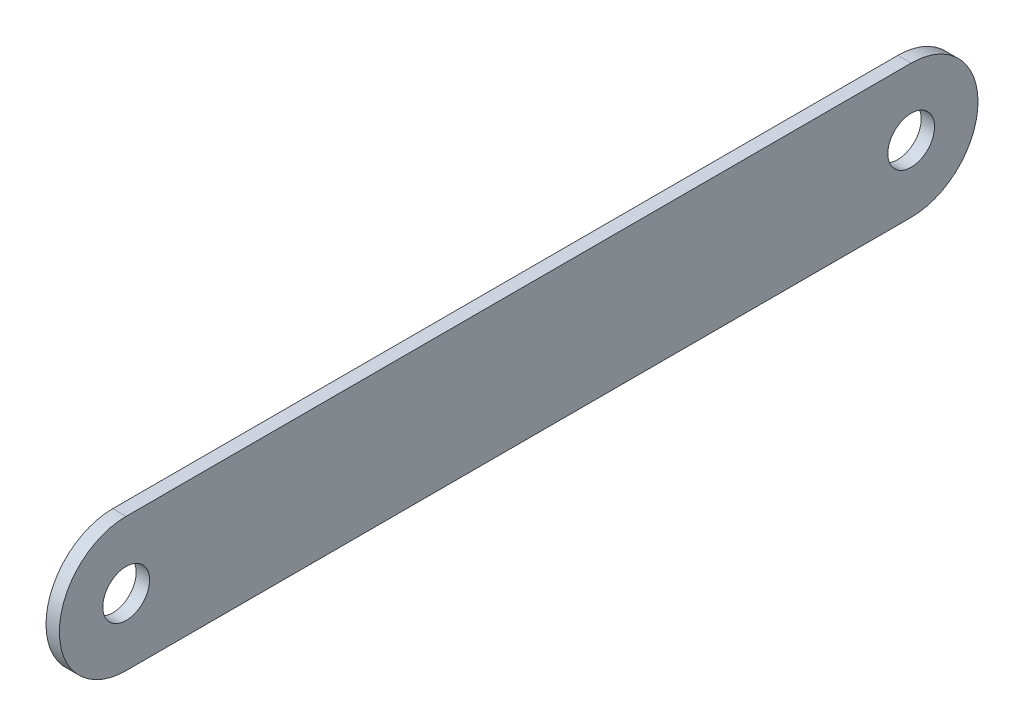
ISO-10303-21;
HEADER;
FILE_DESCRIPTION(('STEP AP214'),'2;1');
FILE_NAME('part.step','',(''),(''),'','','');
FILE_SCHEMA(('AUTOMOTIVE_DESIGN { 1 0 10303 214 1 1 1 1 }'));
ENDSEC;
DATA;
#1=APPLICATION_CONTEXT('core data for automotive mechanical design processes');
#2=APPLICATION_PROTOCOL_DEFINITION('international standard','automotive_design',2000,#1);
#3=PRODUCT_CONTEXT('',#1,'mechanical');
#4=PRODUCT('Part','Part','',(#3));
#5=PRODUCT_RELATED_PRODUCT_CATEGORY('part','',(#4));
#6=PRODUCT_DEFINITION_FORMATION('','',#4);
#7=PRODUCT_DEFINITION_CONTEXT('part definition',#1,'design');
#8=PRODUCT_DEFINITION('design','',#6,#7);
#9=PRODUCT_DEFINITION_SHAPE('','',#8);
#10=(LENGTH_UNIT() NAMED_UNIT(*) SI_UNIT(.MILLI.,.METRE.));
#11=(NAMED_UNIT(*) PLANE_ANGLE_UNIT() SI_UNIT($,.RADIAN.));
#12=(NAMED_UNIT(*) SI_UNIT($,.STERADIAN.) SOLID_ANGLE_UNIT());
#13=UNCERTAINTY_MEASURE_WITH_UNIT(LENGTH_MEASURE(1.E-05),#10,'distance_accuracy_value','');
#14=(GEOMETRIC_REPRESENTATION_CONTEXT(3) GLOBAL_UNCERTAINTY_ASSIGNED_CONTEXT((#13)) GLOBAL_UNIT_ASSIGNED_CONTEXT((#10,
#11,#12)) REPRESENTATION_CONTEXT('',''));
#15=CARTESIAN_POINT('',(0.,0.,0.));
#16=DIRECTION('',(0.,0.,1.));
#17=DIRECTION('',(1.,0.,0.));
#18=AXIS2_PLACEMENT_3D('',#15,#16,#17);
#19=CARTESIAN_POINT('',(-4.,0.,0.));
#20=DIRECTION('',(1.,0.,0.));
#21=DIRECTION('',(0.,0.,-1.));
#22=AXIS2_PLACEMENT_3D('',#19,#20,#21);
#23=CYLINDRICAL_SURFACE('',#22,20.);
#24=CARTESIAN_POINT('',(0.,0.,0.));
#25=DIRECTION('',(1.,0.,0.));
#26=DIRECTION('',(0.,0.,-1.));
#27=AXIS2_PLACEMENT_3D('',#24,#25,#26);
#28=CIRCLE('',#27,20.);
#29=CARTESIAN_POINT('',(0.,20.,0.));
#30=VERTEX_POINT('',#29);
#31=CARTESIAN_POINT('',(0.,-20.,0.));
#32=VERTEX_POINT('',#31);
#33=EDGE_CURVE('E107',#30,#32,#28,.T.);
#34=ORIENTED_EDGE('',*,*,#33,.F.);
#35=DIRECTION('',(1.,0.,0.));
#36=VECTOR('',#35,1.);
#37=CARTESIAN_POINT('',(-4.,20.,0.));
#38=LINE('',#37,#36);
#39=CARTESIAN_POINT('',(-4.,20.,0.));
#40=VERTEX_POINT('',#39);
#41=EDGE_CURVE('E11',#40,#30,#38,.T.);
#42=ORIENTED_EDGE('',*,*,#41,.F.);
#43=CARTESIAN_POINT('',(-4.,0.,0.));
#44=DIRECTION('',(1.,0.,0.));
#45=DIRECTION('',(0.,0.,-1.));
#46=AXIS2_PLACEMENT_3D('',#43,#44,#45);
#47=CIRCLE('',#46,20.);
#48=CARTESIAN_POINT('',(-4.,-20.,0.));
#49=VERTEX_POINT('',#48);
#50=EDGE_CURVE('E100',#40,#49,#47,.T.);
#51=ORIENTED_EDGE('',*,*,#50,.T.);
#52=DIRECTION('',(1.,0.,0.));
#53=VECTOR('',#52,1.);
#54=CARTESIAN_POINT('',(-4.,-20.,0.));
#55=LINE('',#54,#53);
#56=EDGE_CURVE('E45',#49,#32,#55,.T.);
#57=ORIENTED_EDGE('',*,*,#56,.T.);
#58=EDGE_LOOP('',(#34,#42,#51,#57));
#59=FACE_BOUND('',#58,.T.);
#60=ADVANCED_FACE('F42',(#59),#23,.T.);
#61=CARTESIAN_POINT('',(-4.,20.,0.));
#62=DIRECTION('',(0.,1.,0.));
#63=DIRECTION('',(0.,0.,1.));
#64=AXIS2_PLACEMENT_3D('',#61,#62,#63);
#65=PLANE('',#64);
#66=DIRECTION('',(0.,0.,1.));
#67=VECTOR('',#66,1.);
#68=CARTESIAN_POINT('',(0.,20.,0.));
#69=LINE('',#68,#67);
#70=CARTESIAN_POINT('',(0.,20.,-235.));
#71=VERTEX_POINT('',#70);
#72=EDGE_CURVE('E102',#71,#30,#69,.T.);
#73=ORIENTED_EDGE('',*,*,#72,.F.);
#74=DIRECTION('',(1.,0.,0.));
#75=VECTOR('',#74,1.);
#76=CARTESIAN_POINT('',(-4.,20.,-235.));
#77=LINE('',#76,#75);
#78=CARTESIAN_POINT('',(-4.,20.,-235.));
#79=VERTEX_POINT('',#78);
#80=EDGE_CURVE('E51',#79,#71,#77,.T.);
#81=ORIENTED_EDGE('',*,*,#80,.F.);
#82=DIRECTION('',(0.,0.,1.));
#83=VECTOR('',#82,1.);
#84=CARTESIAN_POINT('',(-4.,20.,0.));
#85=LINE('',#84,#83);
#86=EDGE_CURVE('E97',#79,#40,#85,.T.);
#87=ORIENTED_EDGE('',*,*,#86,.T.);
#88=ORIENTED_EDGE('',*,*,#41,.T.);
#89=EDGE_LOOP('',(#73,#81,#87,#88));
#90=FACE_BOUND('',#89,.T.);
#91=ADVANCED_FACE('F118',(#90),#65,.T.);
#92=CARTESIAN_POINT('',(-4.,0.,-235.));
#93=DIRECTION('',(1.,0.,0.));
#94=DIRECTION('',(0.,0.,-1.));
#95=AXIS2_PLACEMENT_3D('',#92,#93,#94);
#96=CYLINDRICAL_SURFACE('',#95,20.);
#97=CARTESIAN_POINT('',(0.,0.,-235.));
#98=DIRECTION('',(1.,0.,0.));
#99=DIRECTION('',(0.,0.,-1.));
#100=AXIS2_PLACEMENT_3D('',#97,#98,#99);
#101=CIRCLE('',#100,20.);
#102=CARTESIAN_POINT('',(0.,-20.,-235.));
#103=VERTEX_POINT('',#102);
#104=EDGE_CURVE('E92',#103,#71,#101,.T.);
#105=ORIENTED_EDGE('',*,*,#104,.F.);
#106=DIRECTION('',(1.,0.,0.));
#107=VECTOR('',#106,1.);
#108=CARTESIAN_POINT('',(-4.,-20.,-235.));
#109=LINE('',#108,#107);
#110=CARTESIAN_POINT('',(-4.,-20.,-235.));
#111=VERTEX_POINT('',#110);
#112=EDGE_CURVE('E87',#111,#103,#109,.T.);
#113=ORIENTED_EDGE('',*,*,#112,.F.);
#114=CARTESIAN_POINT('',(-4.,0.,-235.));
#115=DIRECTION('',(1.,0.,0.));
#116=DIRECTION('',(0.,0.,-1.));
#117=AXIS2_PLACEMENT_3D('',#114,#115,#116);
#118=CIRCLE('',#117,20.);
#119=EDGE_CURVE('E90',#111,#79,#118,.T.);
#120=ORIENTED_EDGE('',*,*,#119,.T.);
#121=ORIENTED_EDGE('',*,*,#80,.T.);
#122=EDGE_LOOP('',(#105,#113,#120,#121));
#123=FACE_BOUND('',#122,.T.);
#124=ADVANCED_FACE('F89',(#123),#96,.T.);
#125=CARTESIAN_POINT('',(-4.,-20.,0.));
#126=DIRECTION('',(0.,-1.,0.));
#127=DIRECTION('',(0.,0.,-1.));
#128=AXIS2_PLACEMENT_3D('',#125,#126,#127);
#129=PLANE('',#128);
#130=DIRECTION('',(0.,0.,-1.));
#131=VECTOR('',#130,1.);
#132=CARTESIAN_POINT('',(0.,-20.,0.));
#133=LINE('',#132,#131);
#134=EDGE_CURVE('E110',#32,#103,#133,.T.);
#135=ORIENTED_EDGE('',*,*,#134,.F.);
#136=ORIENTED_EDGE('',*,*,#56,.F.);
#137=DIRECTION('',(0.,0.,-1.));
#138=VECTOR('',#137,1.);
#139=CARTESIAN_POINT('',(-4.,-20.,0.));
#140=LINE('',#139,#138);
#141=EDGE_CURVE('E96',#49,#111,#140,.T.);
#142=ORIENTED_EDGE('',*,*,#141,.T.);
#143=ORIENTED_EDGE('',*,*,#112,.T.);
#144=EDGE_LOOP('',(#135,#136,#142,#143));
#145=FACE_BOUND('',#144,.T.);
#146=ADVANCED_FACE('F99',(#145),#129,.T.);
#147=CARTESIAN_POINT('',(-4.,0.,0.));
#148=DIRECTION('',(1.,0.,0.));
#149=DIRECTION('',(0.,0.,-1.));
#150=AXIS2_PLACEMENT_3D('',#147,#148,#149);
#151=PLANE('',#150);
#152=CARTESIAN_POINT('',(-4.,0.,-235.));
#153=DIRECTION('',(1.,0.,0.));
#154=DIRECTION('',(0.,0.,-1.));
#155=AXIS2_PLACEMENT_3D('',#152,#153,#154);
#156=CIRCLE('',#155,6.99999999999998);
#157=CARTESIAN_POINT('',(-4.,0.,-242.));
#158=VERTEX_POINT('',#157);
#159=EDGE_CURVE('E151',#158,#158,#156,.T.);
#160=ORIENTED_EDGE('',*,*,#159,.T.);
#161=EDGE_LOOP('',(#160));
#162=FACE_BOUND('',#161,.T.);
#163=CARTESIAN_POINT('',(-4.,0.,0.));
#164=DIRECTION('',(1.,0.,0.));
#165=DIRECTION('',(0.,0.,-1.));
#166=AXIS2_PLACEMENT_3D('',#163,#164,#165);
#167=CIRCLE('',#166,7.);
#168=CARTESIAN_POINT('',(-4.,0.,-7.));
#169=VERTEX_POINT('',#168);
#170=EDGE_CURVE('E111',#169,#169,#167,.T.);
#171=ORIENTED_EDGE('',*,*,#170,.T.);
#172=EDGE_LOOP('',(#171));
#173=FACE_BOUND('',#172,.T.);
#174=ORIENTED_EDGE('',*,*,#50,.F.);
#175=ORIENTED_EDGE('',*,*,#86,.F.);
#176=ORIENTED_EDGE('',*,*,#119,.F.);
#177=ORIENTED_EDGE('',*,*,#141,.F.);
#178=EDGE_LOOP('',(#174,#175,#176,#177));
#179=FACE_BOUND('',#178,.T.);
#180=ADVANCED_FACE('F95',(#162,#173,#179),#151,.F.);
#181=CARTESIAN_POINT('',(0.,0.,0.));
#182=DIRECTION('',(1.,0.,0.));
#183=DIRECTION('',(0.,0.,-1.));
#184=AXIS2_PLACEMENT_3D('',#181,#182,#183);
#185=PLANE('',#184);
#186=CARTESIAN_POINT('',(0.,0.,-235.));
#187=DIRECTION('',(1.,0.,0.));
#188=DIRECTION('',(0.,0.,-1.));
#189=AXIS2_PLACEMENT_3D('',#186,#187,#188);
#190=CIRCLE('',#189,6.99999999999998);
#191=CARTESIAN_POINT('',(0.,0.,-242.));
#192=VERTEX_POINT('',#191);
#193=EDGE_CURVE('E154',#192,#192,#190,.T.);
#194=ORIENTED_EDGE('',*,*,#193,.F.);
#195=EDGE_LOOP('',(#194));
#196=FACE_BOUND('',#195,.T.);
#197=CARTESIAN_POINT('',(0.,0.,0.));
#198=DIRECTION('',(1.,0.,0.));
#199=DIRECTION('',(0.,0.,-1.));
#200=AXIS2_PLACEMENT_3D('',#197,#198,#199);
#201=CIRCLE('',#200,7.);
#202=CARTESIAN_POINT('',(0.,0.,-7.));
#203=VERTEX_POINT('',#202);
#204=EDGE_CURVE('E156',#203,#203,#201,.T.);
#205=ORIENTED_EDGE('',*,*,#204,.F.);
#206=EDGE_LOOP('',(#205));
#207=FACE_BOUND('',#206,.T.);
#208=ORIENTED_EDGE('',*,*,#33,.T.);
#209=ORIENTED_EDGE('',*,*,#134,.T.);
#210=ORIENTED_EDGE('',*,*,#104,.T.);
#211=ORIENTED_EDGE('',*,*,#72,.T.);
#212=EDGE_LOOP('',(#208,#209,#210,#211));
#213=FACE_BOUND('',#212,.T.);
#214=ADVANCED_FACE('F117',(#196,#207,#213),#185,.T.);
#215=CARTESIAN_POINT('',(-4.,0.,0.));
#216=DIRECTION('',(1.,0.,0.));
#217=DIRECTION('',(0.,0.,-1.));
#218=AXIS2_PLACEMENT_3D('',#215,#216,#217);
#219=CYLINDRICAL_SURFACE('',#218,7.);
#220=ORIENTED_EDGE('',*,*,#170,.F.);
#221=EDGE_LOOP('',(#220));
#222=FACE_BOUND('',#221,.T.);
#223=ORIENTED_EDGE('',*,*,#204,.T.);
#224=EDGE_LOOP('',(#223));
#225=FACE_BOUND('',#224,.T.);
#226=ADVANCED_FACE('F136',(#222,#225),#219,.F.);
#227=CARTESIAN_POINT('',(-4.,0.,-235.));
#228=DIRECTION('',(1.,0.,0.));
#229=DIRECTION('',(0.,0.,-1.));
#230=AXIS2_PLACEMENT_3D('',#227,#228,#229);
#231=CYLINDRICAL_SURFACE('',#230,6.99999999999998);
#232=ORIENTED_EDGE('',*,*,#159,.F.);
#233=EDGE_LOOP('',(#232));
#234=FACE_BOUND('',#233,.T.);
#235=ORIENTED_EDGE('',*,*,#193,.T.);
#236=EDGE_LOOP('',(#235));
#237=FACE_BOUND('',#236,.T.);
#238=ADVANCED_FACE('F143',(#234,#237),#231,.F.);
#239=CLOSED_SHELL('',(#60,#91,#124,#146,#180,#214,#226,#238));
#240=MANIFOLD_SOLID_BREP('B2',#239);
#241=ADVANCED_BREP_SHAPE_REPRESENTATION('',(#18,#240),#14);
#242=SHAPE_DEFINITION_REPRESENTATION(#9,#241);
ENDSEC;
END-ISO-10303-21;
